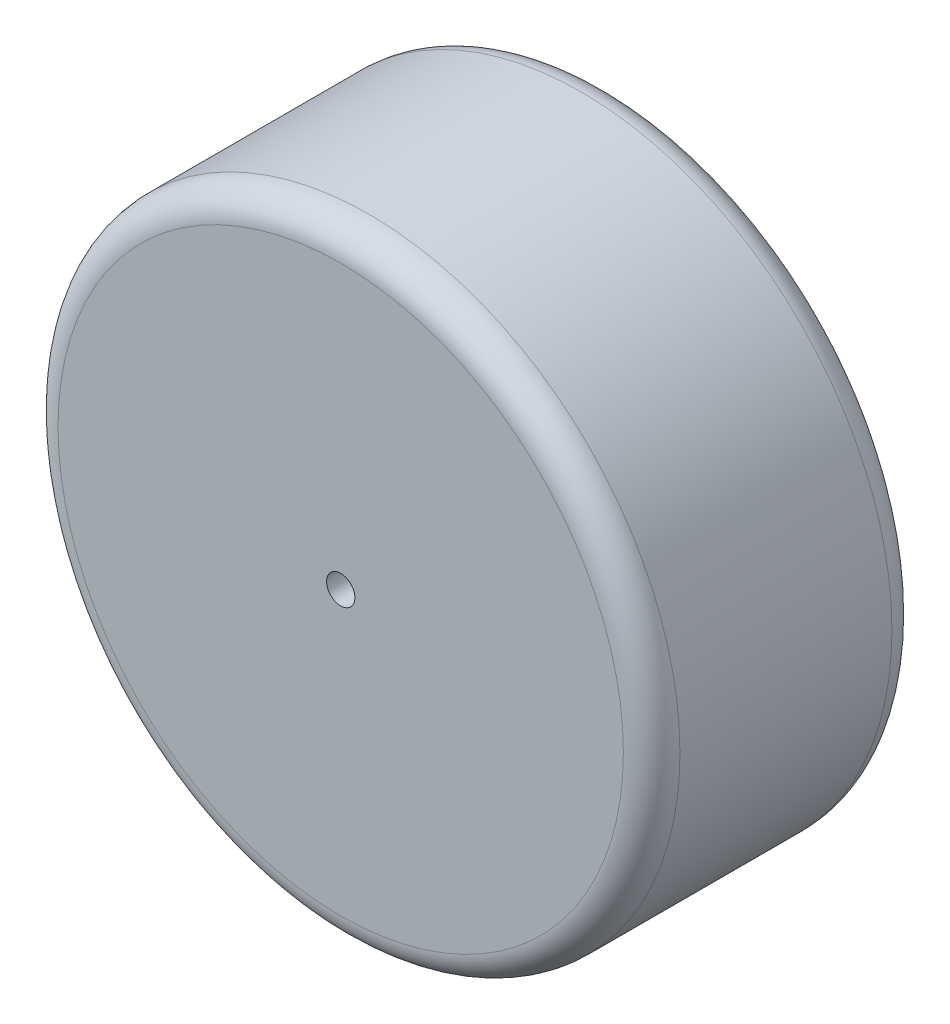
ISO-10303-21;
HEADER;
FILE_DESCRIPTION(('STEP AP214'),'2;1');
FILE_NAME('part.step','',(''),(''),'','','');
FILE_SCHEMA(('AUTOMOTIVE_DESIGN { 1 0 10303 214 1 1 1 1 }'));
ENDSEC;
DATA;
#1=APPLICATION_CONTEXT('core data for automotive mechanical design processes');
#2=APPLICATION_PROTOCOL_DEFINITION('international standard','automotive_design',2000,#1);
#3=PRODUCT_CONTEXT('',#1,'mechanical');
#4=PRODUCT('Part','Part','',(#3));
#5=PRODUCT_RELATED_PRODUCT_CATEGORY('part','',(#4));
#6=PRODUCT_DEFINITION_FORMATION('','',#4);
#7=PRODUCT_DEFINITION_CONTEXT('part definition',#1,'design');
#8=PRODUCT_DEFINITION('design','',#6,#7);
#9=PRODUCT_DEFINITION_SHAPE('','',#8);
#10=(LENGTH_UNIT() NAMED_UNIT(*) SI_UNIT(.MILLI.,.METRE.));
#11=(NAMED_UNIT(*) PLANE_ANGLE_UNIT() SI_UNIT($,.RADIAN.));
#12=(NAMED_UNIT(*) SI_UNIT($,.STERADIAN.) SOLID_ANGLE_UNIT());
#13=UNCERTAINTY_MEASURE_WITH_UNIT(LENGTH_MEASURE(1.E-05),#10,'distance_accuracy_value','');
#14=(GEOMETRIC_REPRESENTATION_CONTEXT(3) GLOBAL_UNCERTAINTY_ASSIGNED_CONTEXT((#13)) GLOBAL_UNIT_ASSIGNED_CONTEXT((#10,
#11,#12)) REPRESENTATION_CONTEXT('',''));
#15=CARTESIAN_POINT('',(0.,0.,0.));
#16=DIRECTION('',(0.,0.,1.));
#17=DIRECTION('',(1.,0.,0.));
#18=AXIS2_PLACEMENT_3D('',#15,#16,#17);
#19=CARTESIAN_POINT('',(0.,0.,9.5));
#20=DIRECTION('',(0.,0.,1.));
#21=DIRECTION('',(1.,0.,0.));
#22=AXIS2_PLACEMENT_3D('',#19,#20,#21);
#23=PLANE('',#22);
#24=CARTESIAN_POINT('',(0.,0.,9.5));
#25=DIRECTION('',(0.,0.,1.));
#26=DIRECTION('',(1.,0.,0.));
#27=AXIS2_PLACEMENT_3D('',#24,#25,#26);
#28=CIRCLE('',#27,10.);
#29=CARTESIAN_POINT('',(10.,0.,9.5));
#30=VERTEX_POINT('',#29);
#31=EDGE_CURVE('E10',#30,#30,#28,.T.);
#32=ORIENTED_EDGE('',*,*,#31,.T.);
#33=EDGE_LOOP('',(#32));
#34=FACE_BOUND('',#33,.T.);
#35=CARTESIAN_POINT('',(0.,0.,9.5));
#36=DIRECTION('',(0.,0.,1.));
#37=DIRECTION('',(1.,0.,0.));
#38=AXIS2_PLACEMENT_3D('',#35,#36,#37);
#39=CIRCLE('',#38,0.5);
#40=CARTESIAN_POINT('',(0.5,0.,9.5));
#41=VERTEX_POINT('',#40);
#42=EDGE_CURVE('E51',#41,#41,#39,.T.);
#43=ORIENTED_EDGE('',*,*,#42,.F.);
#44=EDGE_LOOP('',(#43));
#45=FACE_BOUND('',#44,.T.);
#46=ADVANCED_FACE('F31',(#34,#45),#23,.T.);
#47=CARTESIAN_POINT('',(0.,0.,0.));
#48=DIRECTION('',(0.,0.,1.));
#49=DIRECTION('',(1.,0.,0.));
#50=AXIS2_PLACEMENT_3D('',#47,#48,#49);
#51=PLANE('',#50);
#52=CARTESIAN_POINT('',(0.,0.,0.));
#53=DIRECTION('',(0.,0.,1.));
#54=DIRECTION('',(1.,0.,0.));
#55=AXIS2_PLACEMENT_3D('',#52,#53,#54);
#56=CIRCLE('',#55,10.);
#57=CARTESIAN_POINT('',(10.,0.,0.));
#58=VERTEX_POINT('',#57);
#59=EDGE_CURVE('E38',#58,#58,#56,.F.);
#60=ORIENTED_EDGE('',*,*,#59,.T.);
#61=EDGE_LOOP('',(#60));
#62=FACE_BOUND('',#61,.T.);
#63=CARTESIAN_POINT('',(0.,0.,0.));
#64=DIRECTION('',(0.,0.,1.));
#65=DIRECTION('',(1.,0.,0.));
#66=AXIS2_PLACEMENT_3D('',#63,#64,#65);
#67=CIRCLE('',#66,0.5);
#68=CARTESIAN_POINT('',(0.5,0.,0.));
#69=VERTEX_POINT('',#68);
#70=EDGE_CURVE('E52',#69,#69,#67,.T.);
#71=ORIENTED_EDGE('',*,*,#70,.T.);
#72=EDGE_LOOP('',(#71));
#73=FACE_BOUND('',#72,.T.);
#74=ADVANCED_FACE('F62',(#62,#73),#51,.F.);
#75=CARTESIAN_POINT('',(0.,0.,9.5));
#76=DIRECTION('',(0.,0.,-1.));
#77=DIRECTION('',(-1.,0.,0.));
#78=AXIS2_PLACEMENT_3D('',#75,#76,#77);
#79=CYLINDRICAL_SURFACE('',#78,11.);
#80=CARTESIAN_POINT('',(0.,0.,0.999999999999999));
#81=DIRECTION('',(0.,0.,1.));
#82=DIRECTION('',(1.,0.,0.));
#83=AXIS2_PLACEMENT_3D('',#80,#81,#82);
#84=CIRCLE('',#83,11.);
#85=CARTESIAN_POINT('',(11.,0.,0.999999999999999));
#86=VERTEX_POINT('',#85);
#87=EDGE_CURVE('E42',#86,#86,#84,.T.);
#88=ORIENTED_EDGE('',*,*,#87,.T.);
#89=EDGE_LOOP('',(#88));
#90=FACE_BOUND('',#89,.T.);
#91=CARTESIAN_POINT('',(0.,0.,8.5));
#92=DIRECTION('',(0.,0.,1.));
#93=DIRECTION('',(1.,0.,0.));
#94=AXIS2_PLACEMENT_3D('',#91,#92,#93);
#95=CIRCLE('',#94,11.);
#96=CARTESIAN_POINT('',(11.,0.,8.5));
#97=VERTEX_POINT('',#96);
#98=EDGE_CURVE('E46',#97,#97,#95,.F.);
#99=ORIENTED_EDGE('',*,*,#98,.T.);
#100=EDGE_LOOP('',(#99));
#101=FACE_BOUND('',#100,.T.);
#102=ADVANCED_FACE('F67',(#90,#101),#79,.T.);
#103=CARTESIAN_POINT('',(0.,0.,9.5));
#104=DIRECTION('',(0.,0.,-1.));
#105=DIRECTION('',(-1.,0.,0.));
#106=AXIS2_PLACEMENT_3D('',#103,#104,#105);
#107=CYLINDRICAL_SURFACE('',#106,0.5);
#108=ORIENTED_EDGE('',*,*,#42,.T.);
#109=EDGE_LOOP('',(#108));
#110=FACE_BOUND('',#109,.T.);
#111=ORIENTED_EDGE('',*,*,#70,.F.);
#112=EDGE_LOOP('',(#111));
#113=FACE_BOUND('',#112,.T.);
#114=ADVANCED_FACE('F58',(#110,#113),#107,.F.);
#115=CARTESIAN_POINT('',(0.,0.,0.999999999999999));
#116=DIRECTION('',(0.,0.,1.));
#117=DIRECTION('',(1.,0.,0.));
#118=AXIS2_PLACEMENT_3D('',#115,#116,#117);
#119=TOROIDAL_SURFACE('',#118,10.,1.);
#120=ORIENTED_EDGE('',*,*,#59,.F.);
#121=EDGE_LOOP('',(#120));
#122=FACE_BOUND('',#121,.T.);
#123=ORIENTED_EDGE('',*,*,#87,.F.);
#124=EDGE_LOOP('',(#123));
#125=FACE_BOUND('',#124,.T.);
#126=ADVANCED_FACE('F73',(#122,#125),#119,.T.);
#127=CARTESIAN_POINT('',(0.,0.,8.5));
#128=DIRECTION('',(0.,0.,1.));
#129=DIRECTION('',(1.,0.,0.));
#130=AXIS2_PLACEMENT_3D('',#127,#128,#129);
#131=TOROIDAL_SURFACE('',#130,10.,1.);
#132=ORIENTED_EDGE('',*,*,#98,.F.);
#133=EDGE_LOOP('',(#132));
#134=FACE_BOUND('',#133,.T.);
#135=ORIENTED_EDGE('',*,*,#31,.F.);
#136=EDGE_LOOP('',(#135));
#137=FACE_BOUND('',#136,.T.);
#138=ADVANCED_FACE('F33',(#134,#137),#131,.T.);
#139=CLOSED_SHELL('',(#46,#74,#102,#114,#126,#138));
#140=MANIFOLD_SOLID_BREP('B2',#139);
#141=ADVANCED_BREP_SHAPE_REPRESENTATION('',(#18,#140),#14);
#142=SHAPE_DEFINITION_REPRESENTATION(#9,#141);
ENDSEC;
END-ISO-10303-21;
